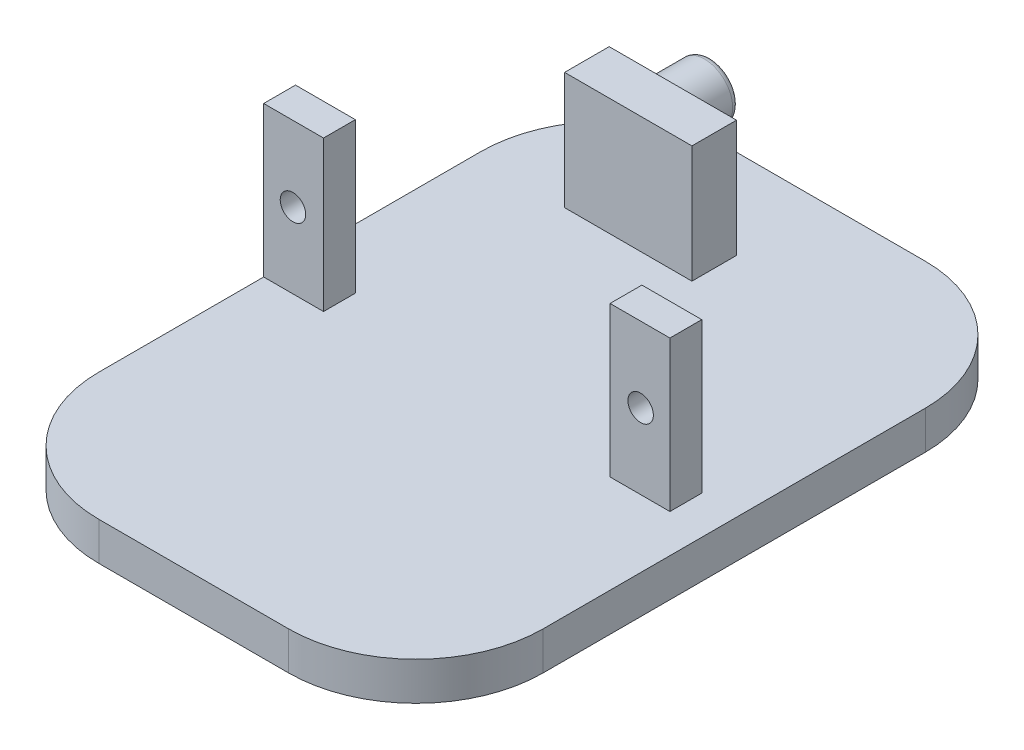
ISO-10303-21;
HEADER;
FILE_DESCRIPTION(('STEP AP214'),'2;1');
FILE_NAME('part.step','',(''),(''),'','','');
FILE_SCHEMA(('AUTOMOTIVE_DESIGN { 1 0 10303 214 1 1 1 1 }'));
ENDSEC;
DATA;
#1=APPLICATION_CONTEXT('core data for automotive mechanical design processes');
#2=APPLICATION_PROTOCOL_DEFINITION('international standard','automotive_design',2000,#1);
#3=PRODUCT_CONTEXT('',#1,'mechanical');
#4=PRODUCT('Part','Part','',(#3));
#5=PRODUCT_RELATED_PRODUCT_CATEGORY('part','',(#4));
#6=PRODUCT_DEFINITION_FORMATION('','',#4);
#7=PRODUCT_DEFINITION_CONTEXT('part definition',#1,'design');
#8=PRODUCT_DEFINITION('design','',#6,#7);
#9=PRODUCT_DEFINITION_SHAPE('','',#8);
#10=(LENGTH_UNIT() NAMED_UNIT(*) SI_UNIT(.MILLI.,.METRE.));
#11=(NAMED_UNIT(*) PLANE_ANGLE_UNIT() SI_UNIT($,.RADIAN.));
#12=(NAMED_UNIT(*) SI_UNIT($,.STERADIAN.) SOLID_ANGLE_UNIT());
#13=UNCERTAINTY_MEASURE_WITH_UNIT(LENGTH_MEASURE(1.E-05),#10,'distance_accuracy_value','');
#14=(GEOMETRIC_REPRESENTATION_CONTEXT(3) GLOBAL_UNCERTAINTY_ASSIGNED_CONTEXT((#13)) GLOBAL_UNIT_ASSIGNED_CONTEXT((#10,
#11,#12)) REPRESENTATION_CONTEXT('',''));
#15=CARTESIAN_POINT('',(0.,0.,0.));
#16=DIRECTION('',(0.,0.,1.));
#17=DIRECTION('',(1.,0.,0.));
#18=AXIS2_PLACEMENT_3D('',#15,#16,#17);
#19=CARTESIAN_POINT('',(0.,3.,50.));
#20=DIRECTION('',(0.,-1.,0.));
#21=DIRECTION('',(0.,0.,-1.));
#22=AXIS2_PLACEMENT_3D('',#19,#20,#21);
#23=PLANE('',#22);
#24=DIRECTION('',(0.,0.,-1.));
#25=VECTOR('',#24,1.);
#26=CARTESIAN_POINT('',(27.2,3.,27.05));
#27=LINE('',#26,#25);
#28=CARTESIAN_POINT('',(27.2,3.,27.05));
#29=VERTEX_POINT('',#28);
#30=CARTESIAN_POINT('',(27.2,3.,24.55));
#31=VERTEX_POINT('',#30);
#32=EDGE_CURVE('E210',#29,#31,#27,.T.);
#33=ORIENTED_EDGE('',*,*,#32,.T.);
#34=DIRECTION('',(1.,0.,0.));
#35=VECTOR('',#34,1.);
#36=CARTESIAN_POINT('',(27.2,3.,24.55));
#37=LINE('',#36,#35);
#38=CARTESIAN_POINT('',(31.9,3.,24.55));
#39=VERTEX_POINT('',#38);
#40=EDGE_CURVE('E179',#31,#39,#37,.T.);
#41=ORIENTED_EDGE('',*,*,#40,.T.);
#42=DIRECTION('',(0.,0.,-1.));
#43=VECTOR('',#42,1.);
#44=CARTESIAN_POINT('',(31.9,3.,27.05));
#45=LINE('',#44,#43);
#46=CARTESIAN_POINT('',(31.9,3.,27.05));
#47=VERTEX_POINT('',#46);
#48=EDGE_CURVE('E206',#47,#39,#45,.T.);
#49=ORIENTED_EDGE('',*,*,#48,.F.);
#50=DIRECTION('',(1.,0.,0.));
#51=VECTOR('',#50,1.);
#52=CARTESIAN_POINT('',(27.2,3.,27.05));
#53=LINE('',#52,#51);
#54=EDGE_CURVE('E190',#29,#47,#53,.T.);
#55=ORIENTED_EDGE('',*,*,#54,.F.);
#56=EDGE_LOOP('',(#33,#41,#49,#55));
#57=FACE_BOUND('',#56,.T.);
#58=DIRECTION('',(-1.,0.,0.));
#59=VECTOR('',#58,1.);
#60=CARTESIAN_POINT('',(0.,3.,50.));
#61=LINE('',#60,#59);
#62=CARTESIAN_POINT('',(24.9,3.,50.));
#63=VERTEX_POINT('',#62);
#64=CARTESIAN_POINT('',(10.,3.,50.));
#65=VERTEX_POINT('',#64);
#66=EDGE_CURVE('E282',#63,#65,#61,.T.);
#67=ORIENTED_EDGE('',*,*,#66,.F.);
#68=CARTESIAN_POINT('',(24.9,3.,40.));
#69=DIRECTION('',(0.,-1.,0.));
#70=DIRECTION('',(0.,0.,-1.));
#71=AXIS2_PLACEMENT_3D('',#68,#69,#70);
#72=CIRCLE('',#71,10.);
#73=CARTESIAN_POINT('',(34.9,3.,40.));
#74=VERTEX_POINT('',#73);
#75=EDGE_CURVE('E322',#63,#74,#72,.F.);
#76=ORIENTED_EDGE('',*,*,#75,.T.);
#77=DIRECTION('',(0.,0.,-1.));
#78=VECTOR('',#77,1.);
#79=CARTESIAN_POINT('',(34.9,3.,50.));
#80=LINE('',#79,#78);
#81=CARTESIAN_POINT('',(34.9,3.,10.));
#82=VERTEX_POINT('',#81);
#83=EDGE_CURVE('E293',#74,#82,#80,.T.);
#84=ORIENTED_EDGE('',*,*,#83,.T.);
#85=CARTESIAN_POINT('',(24.9,3.,10.));
#86=DIRECTION('',(0.,-1.,0.));
#87=DIRECTION('',(0.,0.,-1.));
#88=AXIS2_PLACEMENT_3D('',#85,#86,#87);
#89=CIRCLE('',#88,10.);
#90=CARTESIAN_POINT('',(24.9,3.,0.));
#91=VERTEX_POINT('',#90);
#92=EDGE_CURVE('E320',#82,#91,#89,.F.);
#93=ORIENTED_EDGE('',*,*,#92,.T.);
#94=DIRECTION('',(-1.,0.,0.));
#95=VECTOR('',#94,1.);
#96=CARTESIAN_POINT('',(0.,3.,0.));
#97=LINE('',#96,#95);
#98=CARTESIAN_POINT('',(10.,3.,0.));
#99=VERTEX_POINT('',#98);
#100=EDGE_CURVE('E283',#91,#99,#97,.T.);
#101=ORIENTED_EDGE('',*,*,#100,.T.);
#102=CARTESIAN_POINT('',(10.,3.,10.));
#103=DIRECTION('',(0.,-1.,0.));
#104=DIRECTION('',(0.,0.,-1.));
#105=AXIS2_PLACEMENT_3D('',#102,#103,#104);
#106=CIRCLE('',#105,10.);
#107=CARTESIAN_POINT('',(0.,3.,10.));
#108=VERTEX_POINT('',#107);
#109=EDGE_CURVE('E318',#99,#108,#106,.F.);
#110=ORIENTED_EDGE('',*,*,#109,.T.);
#111=DIRECTION('',(0.,0.,-1.));
#112=VECTOR('',#111,1.);
#113=CARTESIAN_POINT('',(0.,3.,50.));
#114=LINE('',#113,#112);
#115=CARTESIAN_POINT('',(0.,3.,24.55));
#116=VERTEX_POINT('',#115);
#117=EDGE_CURVE('E286',#116,#108,#114,.T.);
#118=ORIENTED_EDGE('',*,*,#117,.F.);
#119=DIRECTION('',(-1.,0.,0.));
#120=VECTOR('',#119,1.);
#121=CARTESIAN_POINT('',(4.7,3.,24.55));
#122=LINE('',#121,#120);
#123=CARTESIAN_POINT('',(4.7,3.,24.55));
#124=VERTEX_POINT('',#123);
#125=EDGE_CURVE('E224',#124,#116,#122,.T.);
#126=ORIENTED_EDGE('',*,*,#125,.F.);
#127=DIRECTION('',(0.,0.,-1.));
#128=VECTOR('',#127,1.);
#129=CARTESIAN_POINT('',(4.7,3.,27.05));
#130=LINE('',#129,#128);
#131=CARTESIAN_POINT('',(4.7,3.,27.05));
#132=VERTEX_POINT('',#131);
#133=EDGE_CURVE('E228',#132,#124,#130,.T.);
#134=ORIENTED_EDGE('',*,*,#133,.F.);
#135=DIRECTION('',(-1.,0.,0.));
#136=VECTOR('',#135,1.);
#137=CARTESIAN_POINT('',(4.7,3.,27.05));
#138=LINE('',#137,#136);
#139=CARTESIAN_POINT('',(0.,3.,27.05));
#140=VERTEX_POINT('',#139);
#141=EDGE_CURVE('E219',#132,#140,#138,.T.);
#142=ORIENTED_EDGE('',*,*,#141,.T.);
#143=CARTESIAN_POINT('',(0.,3.,40.));
#144=VERTEX_POINT('',#143);
#145=EDGE_CURVE('E291',#144,#140,#114,.T.);
#146=ORIENTED_EDGE('',*,*,#145,.F.);
#147=CARTESIAN_POINT('',(10.,3.,40.));
#148=DIRECTION('',(0.,-1.,0.));
#149=DIRECTION('',(0.,0.,-1.));
#150=AXIS2_PLACEMENT_3D('',#147,#148,#149);
#151=CIRCLE('',#150,10.);
#152=EDGE_CURVE('E316',#144,#65,#151,.F.);
#153=ORIENTED_EDGE('',*,*,#152,.T.);
#154=EDGE_LOOP('',(#67,#76,#84,#93,#101,#110,#118,#126,#134,#142,#146,#153));
#155=FACE_BOUND('',#154,.T.);
#156=DIRECTION('',(0.,0.,-1.));
#157=VECTOR('',#156,1.);
#158=CARTESIAN_POINT('',(17.1,3.,10.52));
#159=LINE('',#158,#157);
#160=CARTESIAN_POINT('',(17.1,3.,10.52));
#161=VERTEX_POINT('',#160);
#162=CARTESIAN_POINT('',(17.1,3.,7.02));
#163=VERTEX_POINT('',#162);
#164=EDGE_CURVE('E231',#161,#163,#159,.T.);
#165=ORIENTED_EDGE('',*,*,#164,.F.);
#166=DIRECTION('',(-1.,0.,0.));
#167=VECTOR('',#166,1.);
#168=CARTESIAN_POINT('',(17.1,3.,10.52));
#169=LINE('',#168,#167);
#170=CARTESIAN_POINT('',(7.1,3.,10.52));
#171=VERTEX_POINT('',#170);
#172=EDGE_CURVE('E251',#161,#171,#169,.T.);
#173=ORIENTED_EDGE('',*,*,#172,.T.);
#174=DIRECTION('',(0.,0.,-1.));
#175=VECTOR('',#174,1.);
#176=CARTESIAN_POINT('',(7.1,3.,10.52));
#177=LINE('',#176,#175);
#178=CARTESIAN_POINT('',(7.1,3.,7.02000000000001));
#179=VERTEX_POINT('',#178);
#180=EDGE_CURVE('E265',#171,#179,#177,.T.);
#181=ORIENTED_EDGE('',*,*,#180,.T.);
#182=DIRECTION('',(-1.,0.,0.));
#183=VECTOR('',#182,1.);
#184=CARTESIAN_POINT('',(17.1,3.,7.02));
#185=LINE('',#184,#183);
#186=EDGE_CURVE('E262',#163,#179,#185,.T.);
#187=ORIENTED_EDGE('',*,*,#186,.F.);
#188=EDGE_LOOP('',(#165,#173,#181,#187));
#189=FACE_BOUND('',#188,.T.);
#190=ADVANCED_FACE('F32',(#57,#155,#189),#23,.F.);
#191=CARTESIAN_POINT('',(0.,0.,50.));
#192=DIRECTION('',(1.,0.,0.));
#193=DIRECTION('',(0.,0.,-1.));
#194=AXIS2_PLACEMENT_3D('',#191,#192,#193);
#195=PLANE('',#194);
#196=ORIENTED_EDGE('',*,*,#117,.T.);
#197=DIRECTION('',(0.,-1.,0.));
#198=VECTOR('',#197,1.);
#199=CARTESIAN_POINT('',(0.,0.,10.));
#200=LINE('',#199,#198);
#201=CARTESIAN_POINT('',(0.,0.,10.));
#202=VERTEX_POINT('',#201);
#203=EDGE_CURVE('E11',#108,#202,#200,.T.);
#204=ORIENTED_EDGE('',*,*,#203,.T.);
#205=DIRECTION('',(0.,0.,-1.));
#206=VECTOR('',#205,1.);
#207=CARTESIAN_POINT('',(0.,0.,50.));
#208=LINE('',#207,#206);
#209=CARTESIAN_POINT('',(0.,0.,40.));
#210=VERTEX_POINT('',#209);
#211=EDGE_CURVE('E299',#210,#202,#208,.T.);
#212=ORIENTED_EDGE('',*,*,#211,.F.);
#213=DIRECTION('',(0.,-1.,0.));
#214=VECTOR('',#213,1.);
#215=CARTESIAN_POINT('',(0.,0.,40.));
#216=LINE('',#215,#214);
#217=EDGE_CURVE('E40',#210,#144,#216,.F.);
#218=ORIENTED_EDGE('',*,*,#217,.T.);
#219=ORIENTED_EDGE('',*,*,#145,.T.);
#220=DIRECTION('',(0.,-1.,0.));
#221=VECTOR('',#220,1.);
#222=CARTESIAN_POINT('',(0.,20.1235326616825,27.05));
#223=LINE('',#222,#221);
#224=CARTESIAN_POINT('',(0.,14.8,27.05));
#225=VERTEX_POINT('',#224);
#226=EDGE_CURVE('E234',#225,#140,#223,.T.);
#227=ORIENTED_EDGE('',*,*,#226,.F.);
#228=DIRECTION('',(0.,0.,-1.));
#229=VECTOR('',#228,1.);
#230=CARTESIAN_POINT('',(0.,14.8,27.05));
#231=LINE('',#230,#229);
#232=CARTESIAN_POINT('',(0.,14.8,24.55));
#233=VERTEX_POINT('',#232);
#234=EDGE_CURVE('E237',#225,#233,#231,.T.);
#235=ORIENTED_EDGE('',*,*,#234,.T.);
#236=DIRECTION('',(0.,-1.,0.));
#237=VECTOR('',#236,1.);
#238=CARTESIAN_POINT('',(0.,20.1235326616825,24.55));
#239=LINE('',#238,#237);
#240=EDGE_CURVE('E240',#233,#116,#239,.T.);
#241=ORIENTED_EDGE('',*,*,#240,.T.);
#242=EDGE_LOOP('',(#196,#204,#212,#218,#219,#227,#235,#241));
#243=FACE_BOUND('',#242,.T.);
#244=ADVANCED_FACE('F342',(#243),#195,.F.);
#245=CARTESIAN_POINT('',(0.,0.,50.));
#246=DIRECTION('',(0.,1.,0.));
#247=DIRECTION('',(0.,0.,1.));
#248=AXIS2_PLACEMENT_3D('',#245,#246,#247);
#249=PLANE('',#248);
#250=DIRECTION('',(0.,0.,-1.));
#251=VECTOR('',#250,1.);
#252=CARTESIAN_POINT('',(34.9,0.,50.));
#253=LINE('',#252,#251);
#254=CARTESIAN_POINT('',(34.9,0.,40.));
#255=VERTEX_POINT('',#254);
#256=CARTESIAN_POINT('',(34.9,0.,10.));
#257=VERTEX_POINT('',#256);
#258=EDGE_CURVE('E296',#255,#257,#253,.T.);
#259=ORIENTED_EDGE('',*,*,#258,.F.);
#260=CARTESIAN_POINT('',(24.9,0.,40.));
#261=DIRECTION('',(0.,1.,0.));
#262=DIRECTION('',(0.,0.,1.));
#263=AXIS2_PLACEMENT_3D('',#260,#261,#262);
#264=CIRCLE('',#263,10.);
#265=CARTESIAN_POINT('',(24.9,0.,50.));
#266=VERTEX_POINT('',#265);
#267=EDGE_CURVE('E333',#255,#266,#264,.F.);
#268=ORIENTED_EDGE('',*,*,#267,.T.);
#269=DIRECTION('',(1.,0.,0.));
#270=VECTOR('',#269,1.);
#271=CARTESIAN_POINT('',(0.,0.,50.));
#272=LINE('',#271,#270);
#273=CARTESIAN_POINT('',(10.,0.,50.));
#274=VERTEX_POINT('',#273);
#275=EDGE_CURVE('E279',#274,#266,#272,.T.);
#276=ORIENTED_EDGE('',*,*,#275,.F.);
#277=CARTESIAN_POINT('',(10.,0.,40.));
#278=DIRECTION('',(0.,1.,0.));
#279=DIRECTION('',(0.,0.,1.));
#280=AXIS2_PLACEMENT_3D('',#277,#278,#279);
#281=CIRCLE('',#280,10.);
#282=EDGE_CURVE('E54',#274,#210,#281,.F.);
#283=ORIENTED_EDGE('',*,*,#282,.T.);
#284=ORIENTED_EDGE('',*,*,#211,.T.);
#285=CARTESIAN_POINT('',(10.,0.,10.));
#286=DIRECTION('',(0.,1.,0.));
#287=DIRECTION('',(0.,0.,1.));
#288=AXIS2_PLACEMENT_3D('',#285,#286,#287);
#289=CIRCLE('',#288,10.);
#290=CARTESIAN_POINT('',(10.,0.,0.));
#291=VERTEX_POINT('',#290);
#292=EDGE_CURVE('E47',#202,#291,#289,.F.);
#293=ORIENTED_EDGE('',*,*,#292,.T.);
#294=DIRECTION('',(1.,0.,0.));
#295=VECTOR('',#294,1.);
#296=CARTESIAN_POINT('',(0.,0.,0.));
#297=LINE('',#296,#295);
#298=CARTESIAN_POINT('',(24.9,0.,0.));
#299=VERTEX_POINT('',#298);
#300=EDGE_CURVE('E278',#291,#299,#297,.T.);
#301=ORIENTED_EDGE('',*,*,#300,.T.);
#302=CARTESIAN_POINT('',(24.9,0.,10.));
#303=DIRECTION('',(0.,1.,0.));
#304=DIRECTION('',(0.,0.,1.));
#305=AXIS2_PLACEMENT_3D('',#302,#303,#304);
#306=CIRCLE('',#305,10.);
#307=EDGE_CURVE('E331',#299,#257,#306,.F.);
#308=ORIENTED_EDGE('',*,*,#307,.T.);
#309=EDGE_LOOP('',(#259,#268,#276,#283,#284,#293,#301,#308));
#310=FACE_BOUND('',#309,.T.);
#311=ADVANCED_FACE('F356',(#310),#249,.F.);
#312=CARTESIAN_POINT('',(34.9,0.,50.));
#313=DIRECTION('',(-1.,0.,0.));
#314=DIRECTION('',(0.,0.,1.));
#315=AXIS2_PLACEMENT_3D('',#312,#313,#314);
#316=PLANE('',#315);
#317=ORIENTED_EDGE('',*,*,#83,.F.);
#318=DIRECTION('',(0.,1.,0.));
#319=VECTOR('',#318,1.);
#320=CARTESIAN_POINT('',(34.9,0.,40.));
#321=LINE('',#320,#319);
#322=EDGE_CURVE('E327',#74,#255,#321,.F.);
#323=ORIENTED_EDGE('',*,*,#322,.T.);
#324=ORIENTED_EDGE('',*,*,#258,.T.);
#325=DIRECTION('',(0.,1.,0.));
#326=VECTOR('',#325,1.);
#327=CARTESIAN_POINT('',(34.9,3.,10.));
#328=LINE('',#327,#326);
#329=EDGE_CURVE('E324',#257,#82,#328,.T.);
#330=ORIENTED_EDGE('',*,*,#329,.T.);
#331=EDGE_LOOP('',(#317,#323,#324,#330));
#332=FACE_BOUND('',#331,.T.);
#333=ADVANCED_FACE('F363',(#332),#316,.F.);
#334=CARTESIAN_POINT('',(0.,0.,50.));
#335=DIRECTION('',(0.,0.,-1.));
#336=DIRECTION('',(-1.,0.,0.));
#337=AXIS2_PLACEMENT_3D('',#334,#335,#336);
#338=PLANE('',#337);
#339=ORIENTED_EDGE('',*,*,#275,.T.);
#340=DIRECTION('',(0.,1.,0.));
#341=VECTOR('',#340,1.);
#342=CARTESIAN_POINT('',(24.9,0.,50.));
#343=LINE('',#342,#341);
#344=EDGE_CURVE('E313',#266,#63,#343,.T.);
#345=ORIENTED_EDGE('',*,*,#344,.T.);
#346=ORIENTED_EDGE('',*,*,#66,.T.);
#347=DIRECTION('',(0.,-1.,0.));
#348=VECTOR('',#347,1.);
#349=CARTESIAN_POINT('',(10.,0.,50.));
#350=LINE('',#349,#348);
#351=EDGE_CURVE('E310',#65,#274,#350,.T.);
#352=ORIENTED_EDGE('',*,*,#351,.T.);
#353=EDGE_LOOP('',(#339,#345,#346,#352));
#354=FACE_BOUND('',#353,.T.);
#355=ADVANCED_FACE('F353',(#354),#338,.F.);
#356=CARTESIAN_POINT('',(0.,0.,0.));
#357=DIRECTION('',(0.,0.,-1.));
#358=DIRECTION('',(-1.,0.,0.));
#359=AXIS2_PLACEMENT_3D('',#356,#357,#358);
#360=PLANE('',#359);
#361=ORIENTED_EDGE('',*,*,#100,.F.);
#362=DIRECTION('',(0.,1.,0.));
#363=VECTOR('',#362,1.);
#364=CARTESIAN_POINT('',(24.9,0.,0.));
#365=LINE('',#364,#363);
#366=EDGE_CURVE('E337',#91,#299,#365,.F.);
#367=ORIENTED_EDGE('',*,*,#366,.T.);
#368=ORIENTED_EDGE('',*,*,#300,.F.);
#369=DIRECTION('',(0.,-1.,0.));
#370=VECTOR('',#369,1.);
#371=CARTESIAN_POINT('',(10.,3.,0.));
#372=LINE('',#371,#370);
#373=EDGE_CURVE('E335',#291,#99,#372,.F.);
#374=ORIENTED_EDGE('',*,*,#373,.T.);
#375=EDGE_LOOP('',(#361,#367,#368,#374));
#376=FACE_BOUND('',#375,.T.);
#377=ADVANCED_FACE('F372',(#376),#360,.T.);
#378=CARTESIAN_POINT('',(17.1,12.2,10.52));
#379=DIRECTION('',(-1.,0.,0.));
#380=DIRECTION('',(0.,0.,1.));
#381=AXIS2_PLACEMENT_3D('',#378,#379,#380);
#382=PLANE('',#381);
#383=ORIENTED_EDGE('',*,*,#164,.T.);
#384=DIRECTION('',(0.,-1.,0.));
#385=VECTOR('',#384,1.);
#386=CARTESIAN_POINT('',(17.1,12.2,7.02));
#387=LINE('',#386,#385);
#388=CARTESIAN_POINT('',(17.1,12.2,7.02));
#389=VERTEX_POINT('',#388);
#390=EDGE_CURVE('E276',#389,#163,#387,.T.);
#391=ORIENTED_EDGE('',*,*,#390,.F.);
#392=DIRECTION('',(0.,0.,-1.));
#393=VECTOR('',#392,1.);
#394=CARTESIAN_POINT('',(17.1,12.2,10.52));
#395=LINE('',#394,#393);
#396=CARTESIAN_POINT('',(17.1,12.2,10.52));
#397=VERTEX_POINT('',#396);
#398=EDGE_CURVE('E247',#397,#389,#395,.T.);
#399=ORIENTED_EDGE('',*,*,#398,.F.);
#400=DIRECTION('',(0.,-1.,0.));
#401=VECTOR('',#400,1.);
#402=CARTESIAN_POINT('',(17.1,12.2,10.52));
#403=LINE('',#402,#401);
#404=EDGE_CURVE('E259',#397,#161,#403,.T.);
#405=ORIENTED_EDGE('',*,*,#404,.T.);
#406=EDGE_LOOP('',(#383,#391,#399,#405));
#407=FACE_BOUND('',#406,.T.);
#408=ADVANCED_FACE('F454',(#407),#382,.F.);
#409=CARTESIAN_POINT('',(17.1,12.2,7.02));
#410=DIRECTION('',(0.,0.,1.));
#411=DIRECTION('',(1.,0.,0.));
#412=AXIS2_PLACEMENT_3D('',#409,#410,#411);
#413=PLANE('',#412);
#414=CARTESIAN_POINT('',(10.6,8.9,7.02));
#415=DIRECTION('',(0.,0.,1.));
#416=DIRECTION('',(1.,0.,0.));
#417=AXIS2_PLACEMENT_3D('',#414,#415,#416);
#418=CIRCLE('',#417,2.2);
#419=CARTESIAN_POINT('',(12.8,8.9,7.02));
#420=VERTEX_POINT('',#419);
#421=EDGE_CURVE('E301',#420,#420,#418,.F.);
#422=ORIENTED_EDGE('',*,*,#421,.F.);
#423=EDGE_LOOP('',(#422));
#424=FACE_BOUND('',#423,.T.);
#425=ORIENTED_EDGE('',*,*,#186,.T.);
#426=DIRECTION('',(0.,-1.,0.));
#427=VECTOR('',#426,1.);
#428=CARTESIAN_POINT('',(7.1,12.2,7.02000000000001));
#429=LINE('',#428,#427);
#430=CARTESIAN_POINT('',(7.1,12.2,7.02000000000001));
#431=VERTEX_POINT('',#430);
#432=EDGE_CURVE('E274',#431,#179,#429,.T.);
#433=ORIENTED_EDGE('',*,*,#432,.F.);
#434=DIRECTION('',(-1.,0.,0.));
#435=VECTOR('',#434,1.);
#436=CARTESIAN_POINT('',(17.1,12.2,7.02));
#437=LINE('',#436,#435);
#438=EDGE_CURVE('E250',#389,#431,#437,.T.);
#439=ORIENTED_EDGE('',*,*,#438,.F.);
#440=ORIENTED_EDGE('',*,*,#390,.T.);
#441=EDGE_LOOP('',(#425,#433,#439,#440));
#442=FACE_BOUND('',#441,.T.);
#443=ADVANCED_FACE('F606',(#424,#442),#413,.F.);
#444=CARTESIAN_POINT('',(7.1,12.2,10.52));
#445=DIRECTION('',(-1.,0.,0.));
#446=DIRECTION('',(0.,0.,1.));
#447=AXIS2_PLACEMENT_3D('',#444,#445,#446);
#448=PLANE('',#447);
#449=ORIENTED_EDGE('',*,*,#180,.F.);
#450=DIRECTION('',(0.,-1.,0.));
#451=VECTOR('',#450,1.);
#452=CARTESIAN_POINT('',(7.1,12.2,10.52));
#453=LINE('',#452,#451);
#454=CARTESIAN_POINT('',(7.1,12.2,10.52));
#455=VERTEX_POINT('',#454);
#456=EDGE_CURVE('E271',#455,#171,#453,.T.);
#457=ORIENTED_EDGE('',*,*,#456,.F.);
#458=DIRECTION('',(0.,0.,-1.));
#459=VECTOR('',#458,1.);
#460=CARTESIAN_POINT('',(7.1,12.2,10.52));
#461=LINE('',#460,#459);
#462=EDGE_CURVE('E253',#455,#431,#461,.T.);
#463=ORIENTED_EDGE('',*,*,#462,.T.);
#464=ORIENTED_EDGE('',*,*,#432,.T.);
#465=EDGE_LOOP('',(#449,#457,#463,#464));
#466=FACE_BOUND('',#465,.T.);
#467=ADVANCED_FACE('F611',(#466),#448,.T.);
#468=CARTESIAN_POINT('',(17.1,12.2,10.52));
#469=DIRECTION('',(0.,0.,1.));
#470=DIRECTION('',(1.,0.,0.));
#471=AXIS2_PLACEMENT_3D('',#468,#469,#470);
#472=PLANE('',#471);
#473=ORIENTED_EDGE('',*,*,#172,.F.);
#474=ORIENTED_EDGE('',*,*,#404,.F.);
#475=DIRECTION('',(-1.,0.,0.));
#476=VECTOR('',#475,1.);
#477=CARTESIAN_POINT('',(17.1,12.2,10.52));
#478=LINE('',#477,#476);
#479=EDGE_CURVE('E256',#397,#455,#478,.T.);
#480=ORIENTED_EDGE('',*,*,#479,.T.);
#481=ORIENTED_EDGE('',*,*,#456,.T.);
#482=EDGE_LOOP('',(#473,#474,#480,#481));
#483=FACE_BOUND('',#482,.T.);
#484=ADVANCED_FACE('F621',(#483),#472,.T.);
#485=CARTESIAN_POINT('',(0.,12.2,0.));
#486=DIRECTION('',(0.,1.,0.));
#487=DIRECTION('',(0.,0.,1.));
#488=AXIS2_PLACEMENT_3D('',#485,#486,#487);
#489=PLANE('',#488);
#490=ORIENTED_EDGE('',*,*,#398,.T.);
#491=ORIENTED_EDGE('',*,*,#438,.T.);
#492=ORIENTED_EDGE('',*,*,#462,.F.);
#493=ORIENTED_EDGE('',*,*,#479,.F.);
#494=EDGE_LOOP('',(#490,#491,#492,#493));
#495=FACE_BOUND('',#494,.T.);
#496=ADVANCED_FACE('F599',(#495),#489,.T.);
#497=CARTESIAN_POINT('',(10.6,8.9,-3.70253967444162));
#498=DIRECTION('',(0.,0.,1.));
#499=DIRECTION('',(1.,0.,0.));
#500=AXIS2_PLACEMENT_3D('',#497,#498,#499);
#501=CYLINDRICAL_SURFACE('',#500,2.2);
#502=CARTESIAN_POINT('',(10.6,8.9,3.02));
#503=DIRECTION('',(0.,0.,-1.));
#504=DIRECTION('',(0.,1.,0.));
#505=AXIS2_PLACEMENT_3D('',#502,#503,#504);
#506=CIRCLE('',#505,2.2);
#507=CARTESIAN_POINT('',(10.6,11.1,3.02));
#508=VERTEX_POINT('',#507);
#509=EDGE_CURVE('E307',#508,#508,#506,.F.);
#510=ORIENTED_EDGE('',*,*,#509,.T.);
#511=EDGE_LOOP('',(#510));
#512=FACE_BOUND('',#511,.T.);
#513=ORIENTED_EDGE('',*,*,#421,.T.);
#514=EDGE_LOOP('',(#513));
#515=FACE_BOUND('',#514,.T.);
#516=ADVANCED_FACE('F589',(#512,#515),#501,.T.);
#517=CARTESIAN_POINT('',(5.59999999999999,5.60000000000002,2.51999999999999));
#518=DIRECTION('',(0.,0.,-1.));
#519=DIRECTION('',(0.,1.,0.));
#520=AXIS2_PLACEMENT_3D('',#517,#518,#519);
#521=PLANE('',#520);
#522=CARTESIAN_POINT('',(10.6,8.9,2.52));
#523=DIRECTION('',(0.,0.,-1.));
#524=DIRECTION('',(0.,1.,0.));
#525=AXIS2_PLACEMENT_3D('',#522,#523,#524);
#526=CIRCLE('',#525,1.7);
#527=CARTESIAN_POINT('',(10.6,10.6,2.52));
#528=VERTEX_POINT('',#527);
#529=EDGE_CURVE('E304',#528,#528,#526,.T.);
#530=ORIENTED_EDGE('',*,*,#529,.T.);
#531=EDGE_LOOP('',(#530));
#532=FACE_BOUND('',#531,.T.);
#533=ADVANCED_FACE('F399',(#532),#521,.T.);
#534=CARTESIAN_POINT('',(10.6,8.9,3.02));
#535=DIRECTION('',(0.,0.,-1.));
#536=DIRECTION('',(0.,1.,0.));
#537=AXIS2_PLACEMENT_3D('',#534,#535,#536);
#538=TOROIDAL_SURFACE('',#537,1.7,0.5);
#539=ORIENTED_EDGE('',*,*,#509,.F.);
#540=EDGE_LOOP('',(#539));
#541=FACE_BOUND('',#540,.T.);
#542=ORIENTED_EDGE('',*,*,#529,.F.);
#543=EDGE_LOOP('',(#542));
#544=FACE_BOUND('',#543,.T.);
#545=ADVANCED_FACE('F391',(#541,#544),#538,.T.);
#546=CARTESIAN_POINT('',(27.2,14.8,11.15));
#547=DIRECTION('',(0.,1.,0.));
#548=DIRECTION('',(-1.,0.,0.));
#549=AXIS2_PLACEMENT_3D('',#546,#547,#548);
#550=PLANE('',#549);
#551=DIRECTION('',(-1.,0.,0.));
#552=VECTOR('',#551,1.);
#553=CARTESIAN_POINT('',(4.7,14.8,27.05));
#554=LINE('',#553,#552);
#555=CARTESIAN_POINT('',(4.7,14.8,27.05));
#556=VERTEX_POINT('',#555);
#557=EDGE_CURVE('E222',#556,#225,#554,.T.);
#558=ORIENTED_EDGE('',*,*,#557,.F.);
#559=DIRECTION('',(0.,0.,-1.));
#560=VECTOR('',#559,1.);
#561=CARTESIAN_POINT('',(4.7,14.8,27.05));
#562=LINE('',#561,#560);
#563=CARTESIAN_POINT('',(4.7,14.8,24.55));
#564=VERTEX_POINT('',#563);
#565=EDGE_CURVE('E211',#556,#564,#562,.T.);
#566=ORIENTED_EDGE('',*,*,#565,.T.);
#567=DIRECTION('',(-1.,0.,0.));
#568=VECTOR('',#567,1.);
#569=CARTESIAN_POINT('',(4.7,14.8,24.55));
#570=LINE('',#569,#568);
#571=EDGE_CURVE('E223',#564,#233,#570,.T.);
#572=ORIENTED_EDGE('',*,*,#571,.T.);
#573=ORIENTED_EDGE('',*,*,#234,.F.);
#574=EDGE_LOOP('',(#558,#566,#572,#573));
#575=FACE_BOUND('',#574,.T.);
#576=ADVANCED_FACE('F389',(#575),#550,.T.);
#577=CARTESIAN_POINT('',(4.7,20.1235326616825,27.05));
#578=DIRECTION('',(0.,0.,1.));
#579=DIRECTION('',(1.,0.,0.));
#580=AXIS2_PLACEMENT_3D('',#577,#578,#579);
#581=PLANE('',#580);
#582=CARTESIAN_POINT('',(2.30000000000004,8.9,27.05));
#583=DIRECTION('',(0.,0.,1.));
#584=DIRECTION('',(1.,0.,0.));
#585=AXIS2_PLACEMENT_3D('',#582,#583,#584);
#586=CIRCLE('',#585,1.);
#587=CARTESIAN_POINT('',(3.30000000000004,8.9,27.05));
#588=VERTEX_POINT('',#587);
#589=EDGE_CURVE('E670',#588,#588,#586,.T.);
#590=ORIENTED_EDGE('',*,*,#589,.F.);
#591=EDGE_LOOP('',(#590));
#592=FACE_BOUND('',#591,.T.);
#593=DIRECTION('',(0.,-1.,0.));
#594=VECTOR('',#593,1.);
#595=CARTESIAN_POINT('',(4.7,20.1235326616825,27.05));
#596=LINE('',#595,#594);
#597=EDGE_CURVE('E226',#556,#132,#596,.T.);
#598=ORIENTED_EDGE('',*,*,#597,.F.);
#599=ORIENTED_EDGE('',*,*,#557,.T.);
#600=ORIENTED_EDGE('',*,*,#226,.T.);
#601=ORIENTED_EDGE('',*,*,#141,.F.);
#602=EDGE_LOOP('',(#598,#599,#600,#601));
#603=FACE_BOUND('',#602,.T.);
#604=ADVANCED_FACE('F387',(#592,#603),#581,.T.);
#605=CARTESIAN_POINT('',(4.7,20.1235326616825,24.55));
#606=DIRECTION('',(0.,0.,1.));
#607=DIRECTION('',(1.,0.,0.));
#608=AXIS2_PLACEMENT_3D('',#605,#606,#607);
#609=PLANE('',#608);
#610=CARTESIAN_POINT('',(2.30000000000004,8.9,24.55));
#611=DIRECTION('',(0.,0.,1.));
#612=DIRECTION('',(1.,0.,0.));
#613=AXIS2_PLACEMENT_3D('',#610,#611,#612);
#614=CIRCLE('',#613,1.);
#615=CARTESIAN_POINT('',(3.30000000000004,8.9,24.55));
#616=VERTEX_POINT('',#615);
#617=EDGE_CURVE('E201',#616,#616,#614,.F.);
#618=ORIENTED_EDGE('',*,*,#617,.F.);
#619=EDGE_LOOP('',(#618));
#620=FACE_BOUND('',#619,.T.);
#621=ORIENTED_EDGE('',*,*,#571,.F.);
#622=DIRECTION('',(0.,-1.,0.));
#623=VECTOR('',#622,1.);
#624=CARTESIAN_POINT('',(4.7,20.1235326616825,24.55));
#625=LINE('',#624,#623);
#626=EDGE_CURVE('E227',#564,#124,#625,.T.);
#627=ORIENTED_EDGE('',*,*,#626,.T.);
#628=ORIENTED_EDGE('',*,*,#125,.T.);
#629=ORIENTED_EDGE('',*,*,#240,.F.);
#630=EDGE_LOOP('',(#621,#627,#628,#629));
#631=FACE_BOUND('',#630,.T.);
#632=ADVANCED_FACE('F380',(#620,#631),#609,.F.);
#633=CARTESIAN_POINT('',(4.7,20.1235326616825,27.05));
#634=DIRECTION('',(-1.,0.,0.));
#635=DIRECTION('',(0.,0.,1.));
#636=AXIS2_PLACEMENT_3D('',#633,#634,#635);
#637=PLANE('',#636);
#638=ORIENTED_EDGE('',*,*,#565,.F.);
#639=ORIENTED_EDGE('',*,*,#597,.T.);
#640=ORIENTED_EDGE('',*,*,#133,.T.);
#641=ORIENTED_EDGE('',*,*,#626,.F.);
#642=EDGE_LOOP('',(#638,#639,#640,#641));
#643=FACE_BOUND('',#642,.T.);
#644=ADVANCED_FACE('F384',(#643),#637,.F.);
#645=CARTESIAN_POINT('',(27.2,14.8,11.15));
#646=DIRECTION('',(0.,1.,0.));
#647=DIRECTION('',(-1.,0.,0.));
#648=AXIS2_PLACEMENT_3D('',#645,#646,#647);
#649=PLANE('',#648);
#650=DIRECTION('',(0.,0.,-1.));
#651=VECTOR('',#650,1.);
#652=CARTESIAN_POINT('',(27.2,14.8,27.05));
#653=LINE('',#652,#651);
#654=CARTESIAN_POINT('',(27.2,14.8,27.05));
#655=VERTEX_POINT('',#654);
#656=CARTESIAN_POINT('',(27.2,14.8,24.55));
#657=VERTEX_POINT('',#656);
#658=EDGE_CURVE('E172',#655,#657,#653,.T.);
#659=ORIENTED_EDGE('',*,*,#658,.F.);
#660=DIRECTION('',(1.,0.,0.));
#661=VECTOR('',#660,1.);
#662=CARTESIAN_POINT('',(27.2,14.8,27.05));
#663=LINE('',#662,#661);
#664=CARTESIAN_POINT('',(31.9,14.8,27.05));
#665=VERTEX_POINT('',#664);
#666=EDGE_CURVE('E209',#655,#665,#663,.T.);
#667=ORIENTED_EDGE('',*,*,#666,.T.);
#668=DIRECTION('',(0.,0.,-1.));
#669=VECTOR('',#668,1.);
#670=CARTESIAN_POINT('',(31.9,14.8,27.05));
#671=LINE('',#670,#669);
#672=CARTESIAN_POINT('',(31.9,14.8,24.55));
#673=VERTEX_POINT('',#672);
#674=EDGE_CURVE('E175',#665,#673,#671,.T.);
#675=ORIENTED_EDGE('',*,*,#674,.T.);
#676=DIRECTION('',(1.,0.,0.));
#677=VECTOR('',#676,1.);
#678=CARTESIAN_POINT('',(27.2,14.8,24.55));
#679=LINE('',#678,#677);
#680=EDGE_CURVE('E169',#657,#673,#679,.T.);
#681=ORIENTED_EDGE('',*,*,#680,.F.);
#682=EDGE_LOOP('',(#659,#667,#675,#681));
#683=FACE_BOUND('',#682,.T.);
#684=ADVANCED_FACE('F171',(#683),#649,.T.);
#685=CARTESIAN_POINT('',(27.2,20.1235326616825,24.55));
#686=DIRECTION('',(0.,0.,-1.));
#687=DIRECTION('',(-1.,0.,0.));
#688=AXIS2_PLACEMENT_3D('',#685,#686,#687);
#689=PLANE('',#688);
#690=CARTESIAN_POINT('',(29.6,8.9,24.55));
#691=DIRECTION('',(0.,0.,-1.));
#692=DIRECTION('',(-1.,0.,0.));
#693=AXIS2_PLACEMENT_3D('',#690,#691,#692);
#694=CIRCLE('',#693,0.999999999999998);
#695=CARTESIAN_POINT('',(28.6,8.9,24.55));
#696=VERTEX_POINT('',#695);
#697=EDGE_CURVE('E197',#696,#696,#694,.F.);
#698=ORIENTED_EDGE('',*,*,#697,.T.);
#699=EDGE_LOOP('',(#698));
#700=FACE_BOUND('',#699,.T.);
#701=DIRECTION('',(0.,-1.,0.));
#702=VECTOR('',#701,1.);
#703=CARTESIAN_POINT('',(27.2,20.1235326616825,24.55));
#704=LINE('',#703,#702);
#705=EDGE_CURVE('E186',#657,#31,#704,.T.);
#706=ORIENTED_EDGE('',*,*,#705,.F.);
#707=ORIENTED_EDGE('',*,*,#680,.T.);
#708=DIRECTION('',(0.,-1.,0.));
#709=VECTOR('',#708,1.);
#710=CARTESIAN_POINT('',(31.9,20.1235326616825,24.55));
#711=LINE('',#710,#709);
#712=EDGE_CURVE('E180',#673,#39,#711,.T.);
#713=ORIENTED_EDGE('',*,*,#712,.T.);
#714=ORIENTED_EDGE('',*,*,#40,.F.);
#715=EDGE_LOOP('',(#706,#707,#713,#714));
#716=FACE_BOUND('',#715,.T.);
#717=ADVANCED_FACE('F192',(#700,#716),#689,.T.);
#718=CARTESIAN_POINT('',(31.9,20.1235326616825,27.05));
#719=DIRECTION('',(-1.,0.,0.));
#720=DIRECTION('',(0.,0.,1.));
#721=AXIS2_PLACEMENT_3D('',#718,#719,#720);
#722=PLANE('',#721);
#723=ORIENTED_EDGE('',*,*,#674,.F.);
#724=DIRECTION('',(0.,-1.,0.));
#725=VECTOR('',#724,1.);
#726=CARTESIAN_POINT('',(31.9,20.1235326616825,27.05));
#727=LINE('',#726,#725);
#728=EDGE_CURVE('E204',#665,#47,#727,.T.);
#729=ORIENTED_EDGE('',*,*,#728,.T.);
#730=ORIENTED_EDGE('',*,*,#48,.T.);
#731=ORIENTED_EDGE('',*,*,#712,.F.);
#732=EDGE_LOOP('',(#723,#729,#730,#731));
#733=FACE_BOUND('',#732,.T.);
#734=ADVANCED_FACE('F516',(#733),#722,.F.);
#735=CARTESIAN_POINT('',(27.2,20.1235326616825,27.05));
#736=DIRECTION('',(0.,0.,-1.));
#737=DIRECTION('',(-1.,0.,0.));
#738=AXIS2_PLACEMENT_3D('',#735,#736,#737);
#739=PLANE('',#738);
#740=CARTESIAN_POINT('',(29.6,8.9,27.05));
#741=DIRECTION('',(0.,0.,1.));
#742=DIRECTION('',(1.,0.,0.));
#743=AXIS2_PLACEMENT_3D('',#740,#741,#742);
#744=CIRCLE('',#743,0.999999999999998);
#745=CARTESIAN_POINT('',(30.6,8.9,27.05));
#746=VERTEX_POINT('',#745);
#747=EDGE_CURVE('E194',#746,#746,#744,.T.);
#748=ORIENTED_EDGE('',*,*,#747,.F.);
#749=EDGE_LOOP('',(#748));
#750=FACE_BOUND('',#749,.T.);
#751=ORIENTED_EDGE('',*,*,#666,.F.);
#752=DIRECTION('',(0.,-1.,0.));
#753=VECTOR('',#752,1.);
#754=CARTESIAN_POINT('',(27.2,20.1235326616825,27.05));
#755=LINE('',#754,#753);
#756=EDGE_CURVE('E188',#655,#29,#755,.T.);
#757=ORIENTED_EDGE('',*,*,#756,.T.);
#758=ORIENTED_EDGE('',*,*,#54,.T.);
#759=ORIENTED_EDGE('',*,*,#728,.F.);
#760=EDGE_LOOP('',(#751,#757,#758,#759));
#761=FACE_BOUND('',#760,.T.);
#762=ADVANCED_FACE('F511',(#750,#761),#739,.F.);
#763=CARTESIAN_POINT('',(27.2,20.1235326616825,27.05));
#764=DIRECTION('',(-1.,0.,0.));
#765=DIRECTION('',(0.,0.,1.));
#766=AXIS2_PLACEMENT_3D('',#763,#764,#765);
#767=PLANE('',#766);
#768=ORIENTED_EDGE('',*,*,#756,.F.);
#769=ORIENTED_EDGE('',*,*,#658,.T.);
#770=ORIENTED_EDGE('',*,*,#705,.T.);
#771=ORIENTED_EDGE('',*,*,#32,.F.);
#772=EDGE_LOOP('',(#768,#769,#770,#771));
#773=FACE_BOUND('',#772,.T.);
#774=ADVANCED_FACE('F184',(#773),#767,.T.);
#775=CARTESIAN_POINT('',(29.6,8.9,-0.001000000000001));
#776=DIRECTION('',(0.,0.,1.));
#777=DIRECTION('',(1.,0.,0.));
#778=AXIS2_PLACEMENT_3D('',#775,#776,#777);
#779=CYLINDRICAL_SURFACE('',#778,0.999999999999998);
#780=ORIENTED_EDGE('',*,*,#697,.F.);
#781=EDGE_LOOP('',(#780));
#782=FACE_BOUND('',#781,.T.);
#783=ORIENTED_EDGE('',*,*,#747,.T.);
#784=EDGE_LOOP('',(#783));
#785=FACE_BOUND('',#784,.T.);
#786=ADVANCED_FACE('F494',(#782,#785),#779,.F.);
#787=CARTESIAN_POINT('',(2.30000000000004,8.9,-0.001000000000001));
#788=DIRECTION('',(0.,0.,1.));
#789=DIRECTION('',(1.,0.,0.));
#790=AXIS2_PLACEMENT_3D('',#787,#788,#789);
#791=CYLINDRICAL_SURFACE('',#790,1.);
#792=ORIENTED_EDGE('',*,*,#589,.T.);
#793=EDGE_LOOP('',(#792));
#794=FACE_BOUND('',#793,.T.);
#795=ORIENTED_EDGE('',*,*,#617,.T.);
#796=EDGE_LOOP('',(#795));
#797=FACE_BOUND('',#796,.T.);
#798=ADVANCED_FACE('F419',(#794,#797),#791,.F.);
#799=CARTESIAN_POINT('',(24.9,0.,40.));
#800=DIRECTION('',(0.,1.,0.));
#801=DIRECTION('',(0.,0.,1.));
#802=AXIS2_PLACEMENT_3D('',#799,#800,#801);
#803=CYLINDRICAL_SURFACE('',#802,10.);
#804=ORIENTED_EDGE('',*,*,#267,.F.);
#805=ORIENTED_EDGE('',*,*,#322,.F.);
#806=ORIENTED_EDGE('',*,*,#75,.F.);
#807=ORIENTED_EDGE('',*,*,#344,.F.);
#808=EDGE_LOOP('',(#804,#805,#806,#807));
#809=FACE_BOUND('',#808,.T.);
#810=ADVANCED_FACE('F360',(#809),#803,.T.);
#811=CARTESIAN_POINT('',(24.9,0.,10.));
#812=DIRECTION('',(0.,-1.,0.));
#813=DIRECTION('',(0.,0.,-1.));
#814=AXIS2_PLACEMENT_3D('',#811,#812,#813);
#815=CYLINDRICAL_SURFACE('',#814,10.);
#816=ORIENTED_EDGE('',*,*,#307,.F.);
#817=ORIENTED_EDGE('',*,*,#366,.F.);
#818=ORIENTED_EDGE('',*,*,#92,.F.);
#819=ORIENTED_EDGE('',*,*,#329,.F.);
#820=EDGE_LOOP('',(#816,#817,#818,#819));
#821=FACE_BOUND('',#820,.T.);
#822=ADVANCED_FACE('F367',(#821),#815,.T.);
#823=CARTESIAN_POINT('',(10.,0.,10.));
#824=DIRECTION('',(0.,1.,0.));
#825=DIRECTION('',(0.,0.,1.));
#826=AXIS2_PLACEMENT_3D('',#823,#824,#825);
#827=CYLINDRICAL_SURFACE('',#826,10.);
#828=ORIENTED_EDGE('',*,*,#109,.F.);
#829=ORIENTED_EDGE('',*,*,#373,.F.);
#830=ORIENTED_EDGE('',*,*,#292,.F.);
#831=ORIENTED_EDGE('',*,*,#203,.F.);
#832=EDGE_LOOP('',(#828,#829,#830,#831));
#833=FACE_BOUND('',#832,.T.);
#834=ADVANCED_FACE('F374',(#833),#827,.T.);
#835=CARTESIAN_POINT('',(10.,0.,40.));
#836=DIRECTION('',(0.,-1.,0.));
#837=DIRECTION('',(0.,0.,-1.));
#838=AXIS2_PLACEMENT_3D('',#835,#836,#837);
#839=CYLINDRICAL_SURFACE('',#838,10.);
#840=ORIENTED_EDGE('',*,*,#152,.F.);
#841=ORIENTED_EDGE('',*,*,#217,.F.);
#842=ORIENTED_EDGE('',*,*,#282,.F.);
#843=ORIENTED_EDGE('',*,*,#351,.F.);
#844=EDGE_LOOP('',(#840,#841,#842,#843));
#845=FACE_BOUND('',#844,.T.);
#846=ADVANCED_FACE('F34',(#845),#839,.T.);
#847=CLOSED_SHELL('',(#190,#244,#311,#333,#355,#377,#408,#443,#467,#484,#496,#516,#533,#545,
#576,#604,#632,#644,#684,#717,#734,#762,#774,#786,#798,#810,#822,#834,#846));
#848=MANIFOLD_SOLID_BREP('B2',#847);
#849=ADVANCED_BREP_SHAPE_REPRESENTATION('',(#18,#848),#14);
#850=SHAPE_DEFINITION_REPRESENTATION(#9,#849);
ENDSEC;
END-ISO-10303-21;
